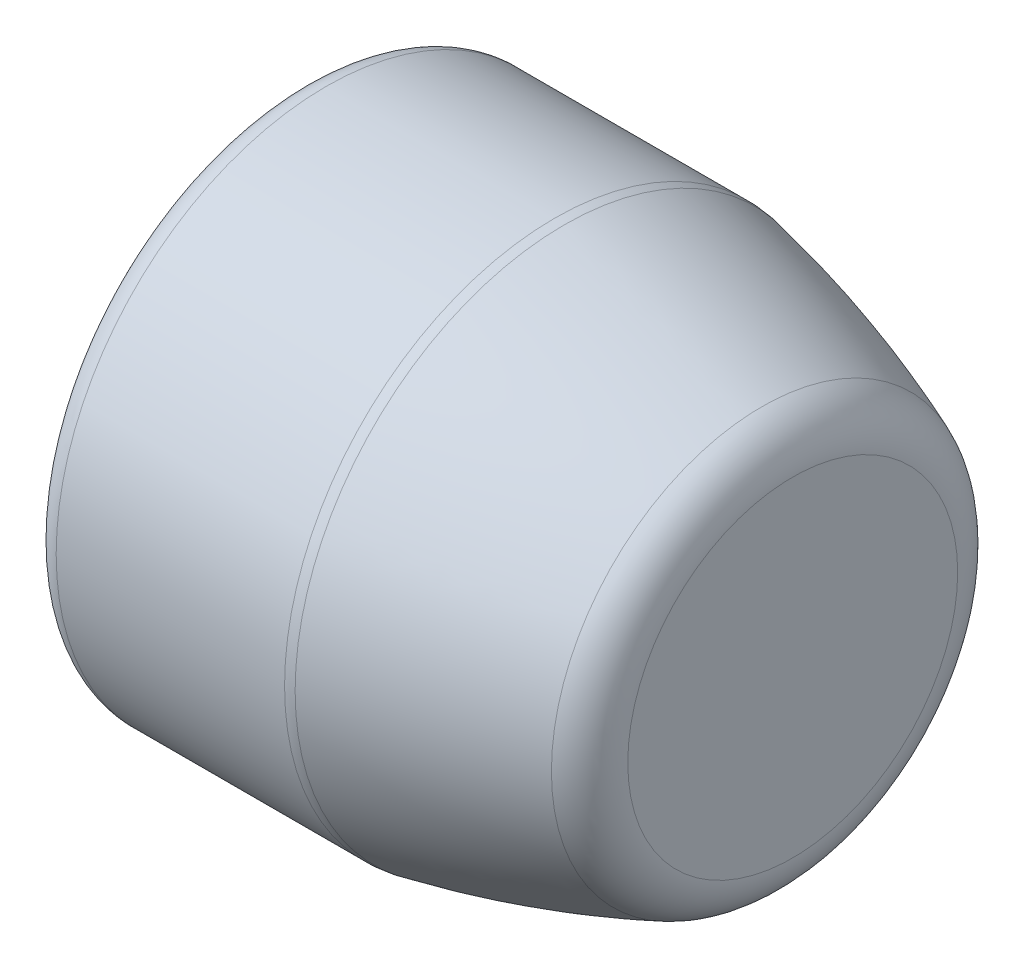
ISO-10303-21;
HEADER;
FILE_DESCRIPTION(('STEP AP214'),'2;1');
FILE_NAME('part.step','',(''),(''),'','','');
FILE_SCHEMA(('AUTOMOTIVE_DESIGN { 1 0 10303 214 1 1 1 1 }'));
ENDSEC;
DATA;
#1=APPLICATION_CONTEXT('core data for automotive mechanical design processes');
#2=APPLICATION_PROTOCOL_DEFINITION('international standard','automotive_design',2000,#1);
#3=PRODUCT_CONTEXT('',#1,'mechanical');
#4=PRODUCT('Part','Part','',(#3));
#5=PRODUCT_RELATED_PRODUCT_CATEGORY('part','',(#4));
#6=PRODUCT_DEFINITION_FORMATION('','',#4);
#7=PRODUCT_DEFINITION_CONTEXT('part definition',#1,'design');
#8=PRODUCT_DEFINITION('design','',#6,#7);
#9=PRODUCT_DEFINITION_SHAPE('','',#8);
#10=(LENGTH_UNIT() NAMED_UNIT(*) SI_UNIT(.MILLI.,.METRE.));
#11=(NAMED_UNIT(*) PLANE_ANGLE_UNIT() SI_UNIT($,.RADIAN.));
#12=(NAMED_UNIT(*) SI_UNIT($,.STERADIAN.) SOLID_ANGLE_UNIT());
#13=UNCERTAINTY_MEASURE_WITH_UNIT(LENGTH_MEASURE(1.E-05),#10,'distance_accuracy_value','');
#14=(GEOMETRIC_REPRESENTATION_CONTEXT(3) GLOBAL_UNCERTAINTY_ASSIGNED_CONTEXT((#13)) GLOBAL_UNIT_ASSIGNED_CONTEXT((#10,
#11,#12)) REPRESENTATION_CONTEXT('',''));
#15=CARTESIAN_POINT('',(0.,0.,0.));
#16=DIRECTION('',(0.,0.,1.));
#17=DIRECTION('',(1.,0.,0.));
#18=AXIS2_PLACEMENT_3D('',#15,#16,#17);
#19=CARTESIAN_POINT('',(2.5,0.,0.));
#20=DIRECTION('',(-1.,0.,0.));
#21=DIRECTION('',(0.,0.,1.));
#22=AXIS2_PLACEMENT_3D('',#19,#20,#21);
#23=CYLINDRICAL_SURFACE('',#22,1.1);
#24=CARTESIAN_POINT('',(0.6,0.,0.));
#25=DIRECTION('',(1.,0.,0.));
#26=DIRECTION('',(0.,0.,-1.));
#27=AXIS2_PLACEMENT_3D('',#24,#25,#26);
#28=CIRCLE('',#27,1.1);
#29=CARTESIAN_POINT('',(0.6,0.,-1.1));
#30=VERTEX_POINT('',#29);
#31=EDGE_CURVE('E37',#30,#30,#28,.T.);
#32=ORIENTED_EDGE('',*,*,#31,.T.);
#33=EDGE_LOOP('',(#32));
#34=FACE_BOUND('',#33,.T.);
#35=CARTESIAN_POINT('',(1.53024650227864,0.,0.));
#36=DIRECTION('',(1.,0.,0.));
#37=DIRECTION('',(0.,0.,-1.));
#38=AXIS2_PLACEMENT_3D('',#35,#36,#37);
#39=CIRCLE('',#38,1.1);
#40=CARTESIAN_POINT('',(1.53024650227864,0.,-1.1));
#41=VERTEX_POINT('',#40);
#42=EDGE_CURVE('E41',#41,#41,#39,.F.);
#43=ORIENTED_EDGE('',*,*,#42,.T.);
#44=EDGE_LOOP('',(#43));
#45=FACE_BOUND('',#44,.T.);
#46=ADVANCED_FACE('F30',(#34,#45),#23,.T.);
#47=CARTESIAN_POINT('',(1.54980635134517,1.1,0.));
#48=CARTESIAN_POINT('',(2.04889983345629,1.00250198129458,0.));
#49=CARTESIAN_POINT('',(2.5,0.804782816751082,0.));
#50=B_SPLINE_CURVE_WITH_KNOTS('',2,(#47,#48,#49),.UNSPECIFIED.,.F.,.F.,(3,3),(0.,
0.445191618800291),.UNSPECIFIED.);
#51=CARTESIAN_POINT('',(1.54980635134517,0.,0.));
#52=DIRECTION('',(-1.,0.,0.));
#53=AXIS1_PLACEMENT('',#51,#52);
#54=SURFACE_OF_REVOLUTION('',#50,#53);
#55=CARTESIAN_POINT('',(2.37455625333324,0.,0.));
#56=DIRECTION('',(-1.,0.,0.));
#57=DIRECTION('',(0.,0.,1.));
#58=AXIS2_PLACEMENT_3D('',#55,#56,#57);
#59=CIRCLE('',#58,0.857455186573992);
#60=CARTESIAN_POINT('',(2.37455625333324,0.,0.857455186573992));
#61=VERTEX_POINT('',#60);
#62=EDGE_CURVE('E50',#61,#61,#59,.T.);
#63=ORIENTED_EDGE('',*,*,#62,.T.);
#64=EDGE_LOOP('',(#63));
#65=FACE_BOUND('',#64,.T.);
#66=CARTESIAN_POINT('',(1.56940838531793,0.,0.));
#67=DIRECTION('',(-1.,0.,0.));
#68=DIRECTION('',(0.,0.,1.));
#69=AXIS2_PLACEMENT_3D('',#66,#67,#68);
#70=CIRCLE('',#69,1.0961283939587);
#71=CARTESIAN_POINT('',(1.56940838531793,0.,1.0961283939587));
#72=VERTEX_POINT('',#71);
#73=EDGE_CURVE('E53',#72,#72,#70,.F.);
#74=ORIENTED_EDGE('',*,*,#73,.T.);
#75=EDGE_LOOP('',(#74));
#76=FACE_BOUND('',#75,.T.);
#77=ADVANCED_FACE('F63',(#65,#76),#54,.F.);
#78=CARTESIAN_POINT('',(2.5,0.,0.));
#79=DIRECTION('',(1.,0.,0.));
#80=DIRECTION('',(0.,0.,-1.));
#81=AXIS2_PLACEMENT_3D('',#78,#79,#80);
#82=PLANE('',#81);
#83=CARTESIAN_POINT('',(2.5,0.,0.));
#84=DIRECTION('',(1.,0.,0.));
#85=DIRECTION('',(0.,0.,-1.));
#86=AXIS2_PLACEMENT_3D('',#83,#84,#85);
#87=CIRCLE('',#86,0.671871337360465);
#88=CARTESIAN_POINT('',(2.5,0.,-0.671871337360465));
#89=VERTEX_POINT('',#88);
#90=EDGE_CURVE('E45',#89,#89,#87,.T.);
#91=ORIENTED_EDGE('',*,*,#90,.T.);
#92=EDGE_LOOP('',(#91));
#93=FACE_BOUND('',#92,.T.);
#94=ADVANCED_FACE('F67',(#93),#82,.T.);
#95=CARTESIAN_POINT('',(2.3,0.,0.));
#96=DIRECTION('',(-1.,0.,0.));
#97=DIRECTION('',(0.,0.,1.));
#98=AXIS2_PLACEMENT_3D('',#95,#96,#97);
#99=TOROIDAL_SURFACE('',#98,0.671871337360465,0.2);
#100=ORIENTED_EDGE('',*,*,#90,.F.);
#101=EDGE_LOOP('',(#100));
#102=FACE_BOUND('',#101,.T.);
#103=ORIENTED_EDGE('',*,*,#62,.F.);
#104=EDGE_LOOP('',(#103));
#105=FACE_BOUND('',#104,.T.);
#106=ADVANCED_FACE('F72',(#102,#105),#99,.T.);
#107=CARTESIAN_POINT('',(1.53024650227864,0.,0.));
#108=DIRECTION('',(1.,0.,0.));
#109=DIRECTION('',(0.,0.,-1.));
#110=AXIS2_PLACEMENT_3D('',#107,#108,#109);
#111=TOROIDAL_SURFACE('',#110,0.9,0.2);
#112=ORIENTED_EDGE('',*,*,#73,.F.);
#113=EDGE_LOOP('',(#112));
#114=FACE_BOUND('',#113,.T.);
#115=ORIENTED_EDGE('',*,*,#42,.F.);
#116=EDGE_LOOP('',(#115));
#117=FACE_BOUND('',#116,.T.);
#118=ADVANCED_FACE('F77',(#114,#117),#111,.T.);
#119=CARTESIAN_POINT('',(0.5,1.1,0.));
#120=DIRECTION('',(1.,0.,0.));
#121=DIRECTION('',(0.,0.,-1.));
#122=AXIS2_PLACEMENT_3D('',#119,#120,#121);
#123=PLANE('',#122);
#124=CARTESIAN_POINT('',(0.5,0.,0.));
#125=DIRECTION('',(1.,0.,0.));
#126=DIRECTION('',(0.,0.,-1.));
#127=AXIS2_PLACEMENT_3D('',#124,#125,#126);
#128=CIRCLE('',#127,1.);
#129=CARTESIAN_POINT('',(0.5,0.,-1.));
#130=VERTEX_POINT('',#129);
#131=EDGE_CURVE('E10',#130,#130,#128,.F.);
#132=ORIENTED_EDGE('',*,*,#131,.T.);
#133=EDGE_LOOP('',(#132));
#134=FACE_BOUND('',#133,.T.);
#135=ADVANCED_FACE('F69',(#134),#123,.F.);
#136=CARTESIAN_POINT('',(0.6,0.,0.));
#137=DIRECTION('',(1.,0.,0.));
#138=DIRECTION('',(0.,0.,-1.));
#139=AXIS2_PLACEMENT_3D('',#136,#137,#138);
#140=TOROIDAL_SURFACE('',#139,1.,0.1);
#141=ORIENTED_EDGE('',*,*,#131,.F.);
#142=EDGE_LOOP('',(#141));
#143=FACE_BOUND('',#142,.T.);
#144=ORIENTED_EDGE('',*,*,#31,.F.);
#145=EDGE_LOOP('',(#144));
#146=FACE_BOUND('',#145,.T.);
#147=ADVANCED_FACE('F32',(#143,#146),#140,.T.);
#148=CLOSED_SHELL('',(#46,#77,#94,#106,#118,#135,#147));
#149=MANIFOLD_SOLID_BREP('B2',#148);
#150=ADVANCED_BREP_SHAPE_REPRESENTATION('',(#18,#149),#14);
#151=SHAPE_DEFINITION_REPRESENTATION(#9,#150);
ENDSEC;
END-ISO-10303-21;
